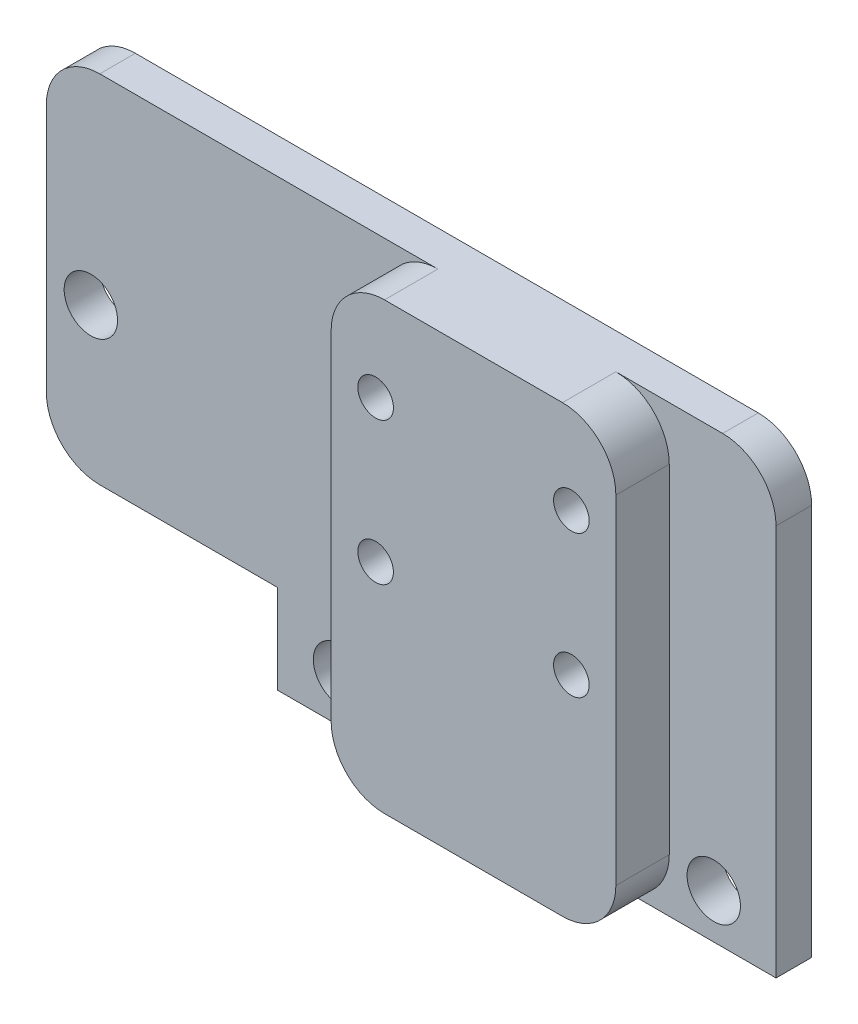
ISO-10303-21;
HEADER;
FILE_DESCRIPTION(('STEP AP214'),'2;1');
FILE_NAME('part.step','',(''),(''),'','','');
FILE_SCHEMA(('AUTOMOTIVE_DESIGN { 1 0 10303 214 1 1 1 1 }'));
ENDSEC;
DATA;
#1=APPLICATION_CONTEXT('core data for automotive mechanical design processes');
#2=APPLICATION_PROTOCOL_DEFINITION('international standard','automotive_design',2000,#1);
#3=PRODUCT_CONTEXT('',#1,'mechanical');
#4=PRODUCT('Part','Part','',(#3));
#5=PRODUCT_RELATED_PRODUCT_CATEGORY('part','',(#4));
#6=PRODUCT_DEFINITION_FORMATION('','',#4);
#7=PRODUCT_DEFINITION_CONTEXT('part definition',#1,'design');
#8=PRODUCT_DEFINITION('design','',#6,#7);
#9=PRODUCT_DEFINITION_SHAPE('','',#8);
#10=(LENGTH_UNIT() NAMED_UNIT(*) SI_UNIT(.MILLI.,.METRE.));
#11=(NAMED_UNIT(*) PLANE_ANGLE_UNIT() SI_UNIT($,.RADIAN.));
#12=(NAMED_UNIT(*) SI_UNIT($,.STERADIAN.) SOLID_ANGLE_UNIT());
#13=UNCERTAINTY_MEASURE_WITH_UNIT(LENGTH_MEASURE(1.E-05),#10,'distance_accuracy_value','');
#14=(GEOMETRIC_REPRESENTATION_CONTEXT(3) GLOBAL_UNCERTAINTY_ASSIGNED_CONTEXT((#13)) GLOBAL_UNIT_ASSIGNED_CONTEXT((#10,
#11,#12)) REPRESENTATION_CONTEXT('',''));
#15=CARTESIAN_POINT('',(0.,0.,0.));
#16=DIRECTION('',(0.,0.,1.));
#17=DIRECTION('',(1.,0.,0.));
#18=AXIS2_PLACEMENT_3D('',#15,#16,#17);
#19=CARTESIAN_POINT('',(0.,0.,2.));
#20=DIRECTION('',(0.,0.,-1.));
#21=DIRECTION('',(-1.,0.,0.));
#22=AXIS2_PLACEMENT_3D('',#19,#20,#21);
#23=PLANE('',#22);
#24=CARTESIAN_POINT('',(-10.5,2.5,2.));
#25=DIRECTION('',(0.,0.,1.));
#26=DIRECTION('',(1.,0.,0.));
#27=AXIS2_PLACEMENT_3D('',#24,#25,#26);
#28=CIRCLE('',#27,1.5);
#29=CARTESIAN_POINT('',(-9.,2.5,2.));
#30=VERTEX_POINT('',#29);
#31=EDGE_CURVE('E345',#30,#30,#28,.T.);
#32=ORIENTED_EDGE('',*,*,#31,.F.);
#33=EDGE_LOOP('',(#32));
#34=FACE_BOUND('',#33,.T.);
#35=CARTESIAN_POINT('',(-24.5,13.5,2.));
#36=DIRECTION('',(0.,0.,1.));
#37=DIRECTION('',(1.,0.,0.));
#38=AXIS2_PLACEMENT_3D('',#35,#36,#37);
#39=CIRCLE('',#38,1.5);
#40=CARTESIAN_POINT('',(-23.,13.5,2.));
#41=VERTEX_POINT('',#40);
#42=EDGE_CURVE('E293',#41,#41,#39,.T.);
#43=ORIENTED_EDGE('',*,*,#42,.F.);
#44=EDGE_LOOP('',(#43));
#45=FACE_BOUND('',#44,.T.);
#46=DIRECTION('',(0.,-1.,0.));
#47=VECTOR('',#46,1.);
#48=CARTESIAN_POINT('',(-27.,5.,2.));
#49=LINE('',#48,#47);
#50=CARTESIAN_POINT('',(-27.,22.,2.));
#51=VERTEX_POINT('',#50);
#52=CARTESIAN_POINT('',(-27.,7.99999999999999,2.));
#53=VERTEX_POINT('',#52);
#54=EDGE_CURVE('E164',#51,#53,#49,.T.);
#55=ORIENTED_EDGE('',*,*,#54,.T.);
#56=CARTESIAN_POINT('',(-24.,7.99999999999999,2.));
#57=DIRECTION('',(0.,0.,-1.));
#58=DIRECTION('',(-1.,0.,0.));
#59=AXIS2_PLACEMENT_3D('',#56,#57,#58);
#60=CIRCLE('',#59,3.);
#61=CARTESIAN_POINT('',(-24.,5.,2.));
#62=VERTEX_POINT('',#61);
#63=EDGE_CURVE('E160',#53,#62,#60,.F.);
#64=ORIENTED_EDGE('',*,*,#63,.T.);
#65=DIRECTION('',(1.,0.,0.));
#66=VECTOR('',#65,1.);
#67=CARTESIAN_POINT('',(-14.,5.,2.));
#68=LINE('',#67,#66);
#69=CARTESIAN_POINT('',(-14.,5.,2.));
#70=VERTEX_POINT('',#69);
#71=EDGE_CURVE('E154',#62,#70,#68,.T.);
#72=ORIENTED_EDGE('',*,*,#71,.T.);
#73=DIRECTION('',(0.,-1.,0.));
#74=VECTOR('',#73,1.);
#75=CARTESIAN_POINT('',(-14.,0.,2.));
#76=LINE('',#75,#74);
#77=CARTESIAN_POINT('',(-14.,0.,2.));
#78=VERTEX_POINT('',#77);
#79=EDGE_CURVE('E157',#70,#78,#76,.T.);
#80=ORIENTED_EDGE('',*,*,#79,.T.);
#81=DIRECTION('',(1.,0.,0.));
#82=VECTOR('',#81,1.);
#83=CARTESIAN_POINT('',(14.,0.,2.));
#84=LINE('',#83,#82);
#85=CARTESIAN_POINT('',(-5.,0.,2.));
#86=VERTEX_POINT('',#85);
#87=EDGE_CURVE('E181',#78,#86,#84,.T.);
#88=ORIENTED_EDGE('',*,*,#87,.T.);
#89=CARTESIAN_POINT('',(-5.,3.,2.));
#90=DIRECTION('',(0.,0.,-1.));
#91=DIRECTION('',(-1.,0.,0.));
#92=AXIS2_PLACEMENT_3D('',#89,#90,#91);
#93=CIRCLE('',#92,3.);
#94=CARTESIAN_POINT('',(-8.,3.,2.));
#95=VERTEX_POINT('',#94);
#96=EDGE_CURVE('E250',#86,#95,#93,.T.);
#97=ORIENTED_EDGE('',*,*,#96,.T.);
#98=DIRECTION('',(0.,-1.,0.));
#99=VECTOR('',#98,1.);
#100=CARTESIAN_POINT('',(-8.,25.,2.));
#101=LINE('',#100,#99);
#102=CARTESIAN_POINT('',(-8.,22.,2.));
#103=VERTEX_POINT('',#102);
#104=EDGE_CURVE('E270',#103,#95,#101,.T.);
#105=ORIENTED_EDGE('',*,*,#104,.F.);
#106=CARTESIAN_POINT('',(-5.,22.,2.));
#107=DIRECTION('',(0.,0.,-1.));
#108=DIRECTION('',(-1.,0.,0.));
#109=AXIS2_PLACEMENT_3D('',#106,#107,#108);
#110=CIRCLE('',#109,3.);
#111=CARTESIAN_POINT('',(-5.,25.,2.));
#112=VERTEX_POINT('',#111);
#113=EDGE_CURVE('E11',#103,#112,#110,.T.);
#114=ORIENTED_EDGE('',*,*,#113,.T.);
#115=DIRECTION('',(-1.,0.,0.));
#116=VECTOR('',#115,1.);
#117=CARTESIAN_POINT('',(-27.,25.,2.));
#118=LINE('',#117,#116);
#119=CARTESIAN_POINT('',(-24.,25.,2.));
#120=VERTEX_POINT('',#119);
#121=EDGE_CURVE('E213',#112,#120,#118,.T.);
#122=ORIENTED_EDGE('',*,*,#121,.T.);
#123=CARTESIAN_POINT('',(-24.,22.,2.));
#124=DIRECTION('',(0.,0.,-1.));
#125=DIRECTION('',(-1.,0.,0.));
#126=AXIS2_PLACEMENT_3D('',#123,#124,#125);
#127=CIRCLE('',#126,3.);
#128=EDGE_CURVE('E241',#120,#51,#127,.F.);
#129=ORIENTED_EDGE('',*,*,#128,.T.);
#130=EDGE_LOOP('',(#55,#64,#72,#80,#88,#97,#105,#114,#122,#129));
#131=FACE_BOUND('',#130,.T.);
#132=ADVANCED_FACE('F33',(#34,#45,#131),#23,.F.);
#133=CARTESIAN_POINT('',(10.5,2.5,2.));
#134=DIRECTION('',(0.,0.,1.));
#135=DIRECTION('',(1.,0.,0.));
#136=AXIS2_PLACEMENT_3D('',#133,#134,#135);
#137=CIRCLE('',#136,1.5);
#138=CARTESIAN_POINT('',(12.,2.5,2.));
#139=VERTEX_POINT('',#138);
#140=EDGE_CURVE('E351',#139,#139,#137,.T.);
#141=ORIENTED_EDGE('',*,*,#140,.F.);
#142=EDGE_LOOP('',(#141));
#143=FACE_BOUND('',#142,.T.);
#144=DIRECTION('',(0.,1.,0.));
#145=VECTOR('',#144,1.);
#146=CARTESIAN_POINT('',(14.,5.,2.));
#147=LINE('',#146,#145);
#148=CARTESIAN_POINT('',(14.,0.,2.));
#149=VERTEX_POINT('',#148);
#150=CARTESIAN_POINT('',(14.,22.,2.));
#151=VERTEX_POINT('',#150);
#152=EDGE_CURVE('E187',#149,#151,#147,.T.);
#153=ORIENTED_EDGE('',*,*,#152,.T.);
#154=CARTESIAN_POINT('',(11.,22.,2.));
#155=DIRECTION('',(0.,0.,-1.));
#156=DIRECTION('',(-1.,0.,0.));
#157=AXIS2_PLACEMENT_3D('',#154,#155,#156);
#158=CIRCLE('',#157,3.);
#159=CARTESIAN_POINT('',(11.,25.,2.));
#160=VERTEX_POINT('',#159);
#161=EDGE_CURVE('E48',#151,#160,#158,.F.);
#162=ORIENTED_EDGE('',*,*,#161,.T.);
#163=CARTESIAN_POINT('',(5.,25.,2.));
#164=VERTEX_POINT('',#163);
#165=EDGE_CURVE('E197',#160,#164,#118,.T.);
#166=ORIENTED_EDGE('',*,*,#165,.T.);
#167=CARTESIAN_POINT('',(5.,22.,2.));
#168=DIRECTION('',(0.,0.,-1.));
#169=DIRECTION('',(-1.,0.,0.));
#170=AXIS2_PLACEMENT_3D('',#167,#168,#169);
#171=CIRCLE('',#170,3.);
#172=CARTESIAN_POINT('',(8.,22.,2.));
#173=VERTEX_POINT('',#172);
#174=EDGE_CURVE('E41',#164,#173,#171,.T.);
#175=ORIENTED_EDGE('',*,*,#174,.T.);
#176=DIRECTION('',(0.,1.,0.));
#177=VECTOR('',#176,1.);
#178=CARTESIAN_POINT('',(8.,25.,2.));
#179=LINE('',#178,#177);
#180=CARTESIAN_POINT('',(8.,3.,2.));
#181=VERTEX_POINT('',#180);
#182=EDGE_CURVE('E257',#181,#173,#179,.T.);
#183=ORIENTED_EDGE('',*,*,#182,.F.);
#184=CARTESIAN_POINT('',(5.,3.,2.));
#185=DIRECTION('',(0.,0.,-1.));
#186=DIRECTION('',(-1.,0.,0.));
#187=AXIS2_PLACEMENT_3D('',#184,#185,#186);
#188=CIRCLE('',#187,3.);
#189=CARTESIAN_POINT('',(5.,0.,2.));
#190=VERTEX_POINT('',#189);
#191=EDGE_CURVE('E247',#181,#190,#188,.T.);
#192=ORIENTED_EDGE('',*,*,#191,.T.);
#193=EDGE_CURVE('E179',#190,#149,#84,.T.);
#194=ORIENTED_EDGE('',*,*,#193,.T.);
#195=EDGE_LOOP('',(#153,#162,#166,#175,#183,#192,#194));
#196=FACE_BOUND('',#195,.T.);
#197=ADVANCED_FACE('F256',(#143,#196),#23,.F.);
#198=CARTESIAN_POINT('',(-27.,5.,2.));
#199=DIRECTION('',(1.,0.,0.));
#200=DIRECTION('',(0.,0.,-1.));
#201=AXIS2_PLACEMENT_3D('',#198,#199,#200);
#202=PLANE('',#201);
#203=DIRECTION('',(0.,-1.,0.));
#204=VECTOR('',#203,1.);
#205=CARTESIAN_POINT('',(-27.,5.,0.));
#206=LINE('',#205,#204);
#207=CARTESIAN_POINT('',(-27.,22.,0.));
#208=VERTEX_POINT('',#207);
#209=CARTESIAN_POINT('',(-27.,7.99999999999999,0.));
#210=VERTEX_POINT('',#209);
#211=EDGE_CURVE('E209',#208,#210,#206,.T.);
#212=ORIENTED_EDGE('',*,*,#211,.T.);
#213=DIRECTION('',(0.,0.,-1.));
#214=VECTOR('',#213,1.);
#215=CARTESIAN_POINT('',(-27.,7.99999999999999,2.));
#216=LINE('',#215,#214);
#217=EDGE_CURVE('E56',#210,#53,#216,.F.);
#218=ORIENTED_EDGE('',*,*,#217,.T.);
#219=ORIENTED_EDGE('',*,*,#54,.F.);
#220=DIRECTION('',(0.,0.,-1.));
#221=VECTOR('',#220,1.);
#222=CARTESIAN_POINT('',(-27.,22.,2.));
#223=LINE('',#222,#221);
#224=EDGE_CURVE('E237',#51,#208,#223,.T.);
#225=ORIENTED_EDGE('',*,*,#224,.T.);
#226=EDGE_LOOP('',(#212,#218,#219,#225));
#227=FACE_BOUND('',#226,.T.);
#228=ADVANCED_FACE('F419',(#227),#202,.F.);
#229=CARTESIAN_POINT('',(-14.,5.,2.));
#230=DIRECTION('',(0.,1.,0.));
#231=DIRECTION('',(-1.,0.,0.));
#232=AXIS2_PLACEMENT_3D('',#229,#230,#231);
#233=PLANE('',#232);
#234=ORIENTED_EDGE('',*,*,#71,.F.);
#235=DIRECTION('',(0.,0.,-1.));
#236=VECTOR('',#235,1.);
#237=CARTESIAN_POINT('',(-24.,5.,2.));
#238=LINE('',#237,#236);
#239=CARTESIAN_POINT('',(-24.,5.,0.));
#240=VERTEX_POINT('',#239);
#241=EDGE_CURVE('E229',#62,#240,#238,.T.);
#242=ORIENTED_EDGE('',*,*,#241,.T.);
#243=DIRECTION('',(1.,0.,0.));
#244=VECTOR('',#243,1.);
#245=CARTESIAN_POINT('',(-14.,5.,0.));
#246=LINE('',#245,#244);
#247=CARTESIAN_POINT('',(-14.,5.,0.));
#248=VERTEX_POINT('',#247);
#249=EDGE_CURVE('E170',#240,#248,#246,.T.);
#250=ORIENTED_EDGE('',*,*,#249,.T.);
#251=DIRECTION('',(0.,0.,-1.));
#252=VECTOR('',#251,1.);
#253=CARTESIAN_POINT('',(-14.,5.,2.));
#254=LINE('',#253,#252);
#255=EDGE_CURVE('E167',#70,#248,#254,.T.);
#256=ORIENTED_EDGE('',*,*,#255,.F.);
#257=EDGE_LOOP('',(#234,#242,#250,#256));
#258=FACE_BOUND('',#257,.T.);
#259=ADVANCED_FACE('F168',(#258),#233,.F.);
#260=CARTESIAN_POINT('',(-14.,0.,2.));
#261=DIRECTION('',(1.,0.,0.));
#262=DIRECTION('',(0.,0.,-1.));
#263=AXIS2_PLACEMENT_3D('',#260,#261,#262);
#264=PLANE('',#263);
#265=DIRECTION('',(0.,-1.,0.));
#266=VECTOR('',#265,1.);
#267=CARTESIAN_POINT('',(-14.,0.,0.));
#268=LINE('',#267,#266);
#269=CARTESIAN_POINT('',(-14.,0.,0.));
#270=VERTEX_POINT('',#269);
#271=EDGE_CURVE('E206',#248,#270,#268,.T.);
#272=ORIENTED_EDGE('',*,*,#271,.T.);
#273=DIRECTION('',(0.,0.,-1.));
#274=VECTOR('',#273,1.);
#275=CARTESIAN_POINT('',(-14.,0.,2.));
#276=LINE('',#275,#274);
#277=EDGE_CURVE('E174',#78,#270,#276,.T.);
#278=ORIENTED_EDGE('',*,*,#277,.F.);
#279=ORIENTED_EDGE('',*,*,#79,.F.);
#280=ORIENTED_EDGE('',*,*,#255,.T.);
#281=EDGE_LOOP('',(#272,#278,#279,#280));
#282=FACE_BOUND('',#281,.T.);
#283=ADVANCED_FACE('F176',(#282),#264,.F.);
#284=CARTESIAN_POINT('',(14.,0.,2.));
#285=DIRECTION('',(0.,1.,0.));
#286=DIRECTION('',(0.,0.,1.));
#287=AXIS2_PLACEMENT_3D('',#284,#285,#286);
#288=PLANE('',#287);
#289=ORIENTED_EDGE('',*,*,#193,.F.);
#290=DIRECTION('',(0.,0.,-1.));
#291=VECTOR('',#290,1.);
#292=CARTESIAN_POINT('',(5.,0.,2.));
#293=LINE('',#292,#291);
#294=CARTESIAN_POINT('',(5.,0.,5.));
#295=VERTEX_POINT('',#294);
#296=EDGE_CURVE('E281',#190,#295,#293,.F.);
#297=ORIENTED_EDGE('',*,*,#296,.T.);
#298=DIRECTION('',(1.,0.,0.));
#299=VECTOR('',#298,1.);
#300=CARTESIAN_POINT('',(-8.,0.,5.));
#301=LINE('',#300,#299);
#302=CARTESIAN_POINT('',(-5.,0.,5.));
#303=VERTEX_POINT('',#302);
#304=EDGE_CURVE('E338',#303,#295,#301,.T.);
#305=ORIENTED_EDGE('',*,*,#304,.F.);
#306=DIRECTION('',(0.,0.,-1.));
#307=VECTOR('',#306,1.);
#308=CARTESIAN_POINT('',(-5.,0.,2.));
#309=LINE('',#308,#307);
#310=EDGE_CURVE('E275',#303,#86,#309,.T.);
#311=ORIENTED_EDGE('',*,*,#310,.T.);
#312=ORIENTED_EDGE('',*,*,#87,.F.);
#313=ORIENTED_EDGE('',*,*,#277,.T.);
#314=DIRECTION('',(1.,0.,0.));
#315=VECTOR('',#314,1.);
#316=CARTESIAN_POINT('',(14.,0.,0.));
#317=LINE('',#316,#315);
#318=CARTESIAN_POINT('',(14.,0.,0.));
#319=VERTEX_POINT('',#318);
#320=EDGE_CURVE('E204',#270,#319,#317,.T.);
#321=ORIENTED_EDGE('',*,*,#320,.T.);
#322=DIRECTION('',(0.,0.,-1.));
#323=VECTOR('',#322,1.);
#324=CARTESIAN_POINT('',(14.,0.,2.));
#325=LINE('',#324,#323);
#326=EDGE_CURVE('E194',#149,#319,#325,.T.);
#327=ORIENTED_EDGE('',*,*,#326,.F.);
#328=EDGE_LOOP('',(#289,#297,#305,#311,#312,#313,#321,#327));
#329=FACE_BOUND('',#328,.T.);
#330=ADVANCED_FACE('F310',(#329),#288,.F.);
#331=CARTESIAN_POINT('',(14.,5.,2.));
#332=DIRECTION('',(-1.,0.,0.));
#333=DIRECTION('',(0.,0.,1.));
#334=AXIS2_PLACEMENT_3D('',#331,#332,#333);
#335=PLANE('',#334);
#336=DIRECTION('',(0.,1.,0.));
#337=VECTOR('',#336,1.);
#338=CARTESIAN_POINT('',(14.,5.,0.));
#339=LINE('',#338,#337);
#340=CARTESIAN_POINT('',(14.,22.,0.));
#341=VERTEX_POINT('',#340);
#342=EDGE_CURVE('E201',#319,#341,#339,.T.);
#343=ORIENTED_EDGE('',*,*,#342,.T.);
#344=DIRECTION('',(0.,0.,1.));
#345=VECTOR('',#344,1.);
#346=CARTESIAN_POINT('',(14.,22.,2.));
#347=LINE('',#346,#345);
#348=EDGE_CURVE('E244',#341,#151,#347,.T.);
#349=ORIENTED_EDGE('',*,*,#348,.T.);
#350=ORIENTED_EDGE('',*,*,#152,.F.);
#351=ORIENTED_EDGE('',*,*,#326,.T.);
#352=EDGE_LOOP('',(#343,#349,#350,#351));
#353=FACE_BOUND('',#352,.T.);
#354=ADVANCED_FACE('F430',(#353),#335,.F.);
#355=CARTESIAN_POINT('',(-27.,25.,2.));
#356=DIRECTION('',(0.,-1.,0.));
#357=DIRECTION('',(0.,0.,-1.));
#358=AXIS2_PLACEMENT_3D('',#355,#356,#357);
#359=PLANE('',#358);
#360=DIRECTION('',(-1.,0.,0.));
#361=VECTOR('',#360,1.);
#362=CARTESIAN_POINT('',(-8.,25.,5.));
#363=LINE('',#362,#361);
#364=CARTESIAN_POINT('',(5.,25.,5.));
#365=VERTEX_POINT('',#364);
#366=CARTESIAN_POINT('',(-5.,25.,5.));
#367=VERTEX_POINT('',#366);
#368=EDGE_CURVE('E210',#365,#367,#363,.T.);
#369=ORIENTED_EDGE('',*,*,#368,.F.);
#370=DIRECTION('',(0.,0.,-1.));
#371=VECTOR('',#370,1.);
#372=CARTESIAN_POINT('',(5.,25.,2.));
#373=LINE('',#372,#371);
#374=EDGE_CURVE('E226',#365,#164,#373,.T.);
#375=ORIENTED_EDGE('',*,*,#374,.T.);
#376=ORIENTED_EDGE('',*,*,#165,.F.);
#377=DIRECTION('',(0.,0.,1.));
#378=VECTOR('',#377,1.);
#379=CARTESIAN_POINT('',(11.,25.,2.));
#380=LINE('',#379,#378);
#381=CARTESIAN_POINT('',(11.,25.,0.));
#382=VERTEX_POINT('',#381);
#383=EDGE_CURVE('E220',#160,#382,#380,.F.);
#384=ORIENTED_EDGE('',*,*,#383,.T.);
#385=DIRECTION('',(-1.,0.,0.));
#386=VECTOR('',#385,1.);
#387=CARTESIAN_POINT('',(-27.,25.,0.));
#388=LINE('',#387,#386);
#389=CARTESIAN_POINT('',(-24.,25.,0.));
#390=VERTEX_POINT('',#389);
#391=EDGE_CURVE('E198',#382,#390,#388,.T.);
#392=ORIENTED_EDGE('',*,*,#391,.T.);
#393=DIRECTION('',(0.,0.,-1.));
#394=VECTOR('',#393,1.);
#395=CARTESIAN_POINT('',(-24.,25.,2.));
#396=LINE('',#395,#394);
#397=EDGE_CURVE('E222',#390,#120,#396,.F.);
#398=ORIENTED_EDGE('',*,*,#397,.T.);
#399=ORIENTED_EDGE('',*,*,#121,.F.);
#400=DIRECTION('',(0.,0.,-1.));
#401=VECTOR('',#400,1.);
#402=CARTESIAN_POINT('',(-5.,25.,2.));
#403=LINE('',#402,#401);
#404=EDGE_CURVE('E224',#112,#367,#403,.F.);
#405=ORIENTED_EDGE('',*,*,#404,.T.);
#406=EDGE_LOOP('',(#369,#375,#376,#384,#392,#398,#399,#405));
#407=FACE_BOUND('',#406,.T.);
#408=ADVANCED_FACE('F333',(#407),#359,.F.);
#409=CARTESIAN_POINT('',(0.,0.,0.));
#410=DIRECTION('',(0.,0.,-1.));
#411=DIRECTION('',(-1.,0.,0.));
#412=AXIS2_PLACEMENT_3D('',#409,#410,#411);
#413=PLANE('',#412);
#414=ORIENTED_EDGE('',*,*,#249,.F.);
#415=CARTESIAN_POINT('',(-24.,7.99999999999999,0.));
#416=DIRECTION('',(0.,0.,-1.));
#417=DIRECTION('',(-1.,0.,0.));
#418=AXIS2_PLACEMENT_3D('',#415,#416,#417);
#419=CIRCLE('',#418,3.);
#420=EDGE_CURVE('E235',#240,#210,#419,.T.);
#421=ORIENTED_EDGE('',*,*,#420,.T.);
#422=ORIENTED_EDGE('',*,*,#211,.F.);
#423=CARTESIAN_POINT('',(-24.,22.,0.));
#424=DIRECTION('',(0.,0.,-1.));
#425=DIRECTION('',(-1.,0.,0.));
#426=AXIS2_PLACEMENT_3D('',#423,#424,#425);
#427=CIRCLE('',#426,3.);
#428=EDGE_CURVE('E233',#208,#390,#427,.T.);
#429=ORIENTED_EDGE('',*,*,#428,.T.);
#430=ORIENTED_EDGE('',*,*,#391,.F.);
#431=CARTESIAN_POINT('',(11.,22.,0.));
#432=DIRECTION('',(0.,0.,-1.));
#433=DIRECTION('',(-1.,0.,0.));
#434=AXIS2_PLACEMENT_3D('',#431,#432,#433);
#435=CIRCLE('',#434,3.);
#436=EDGE_CURVE('E231',#382,#341,#435,.T.);
#437=ORIENTED_EDGE('',*,*,#436,.T.);
#438=ORIENTED_EDGE('',*,*,#342,.F.);
#439=ORIENTED_EDGE('',*,*,#320,.F.);
#440=ORIENTED_EDGE('',*,*,#271,.F.);
#441=EDGE_LOOP('',(#414,#421,#422,#429,#430,#437,#438,#439,#440));
#442=FACE_BOUND('',#441,.T.);
#443=CARTESIAN_POINT('',(5.5,20.,0.));
#444=DIRECTION('',(0.,0.,-1.));
#445=DIRECTION('',(-1.,0.,0.));
#446=AXIS2_PLACEMENT_3D('',#443,#444,#445);
#447=CIRCLE('',#446,1.);
#448=CARTESIAN_POINT('',(4.5,20.,0.));
#449=VERTEX_POINT('',#448);
#450=EDGE_CURVE('E378',#449,#449,#447,.F.);
#451=ORIENTED_EDGE('',*,*,#450,.T.);
#452=EDGE_LOOP('',(#451));
#453=FACE_BOUND('',#452,.T.);
#454=CARTESIAN_POINT('',(5.5,12.,0.));
#455=DIRECTION('',(0.,0.,-1.));
#456=DIRECTION('',(-1.,0.,0.));
#457=AXIS2_PLACEMENT_3D('',#454,#455,#456);
#458=CIRCLE('',#457,1.);
#459=CARTESIAN_POINT('',(4.5,12.,0.));
#460=VERTEX_POINT('',#459);
#461=EDGE_CURVE('E372',#460,#460,#458,.F.);
#462=ORIENTED_EDGE('',*,*,#461,.T.);
#463=EDGE_LOOP('',(#462));
#464=FACE_BOUND('',#463,.T.);
#465=CARTESIAN_POINT('',(-5.5,12.,0.));
#466=DIRECTION('',(0.,0.,-1.));
#467=DIRECTION('',(-1.,0.,0.));
#468=AXIS2_PLACEMENT_3D('',#465,#466,#467);
#469=CIRCLE('',#468,1.);
#470=CARTESIAN_POINT('',(-6.5,12.,0.));
#471=VERTEX_POINT('',#470);
#472=EDGE_CURVE('E366',#471,#471,#469,.F.);
#473=ORIENTED_EDGE('',*,*,#472,.T.);
#474=EDGE_LOOP('',(#473));
#475=FACE_BOUND('',#474,.T.);
#476=CARTESIAN_POINT('',(-5.5,20.,0.));
#477=DIRECTION('',(0.,0.,-1.));
#478=DIRECTION('',(-1.,0.,0.));
#479=AXIS2_PLACEMENT_3D('',#476,#477,#478);
#480=CIRCLE('',#479,1.);
#481=CARTESIAN_POINT('',(-6.5,20.,0.));
#482=VERTEX_POINT('',#481);
#483=EDGE_CURVE('E360',#482,#482,#480,.F.);
#484=ORIENTED_EDGE('',*,*,#483,.T.);
#485=EDGE_LOOP('',(#484));
#486=FACE_BOUND('',#485,.T.);
#487=CARTESIAN_POINT('',(10.5,2.5,0.));
#488=DIRECTION('',(0.,0.,-1.));
#489=DIRECTION('',(-1.,0.,0.));
#490=AXIS2_PLACEMENT_3D('',#487,#488,#489);
#491=CIRCLE('',#490,1.5);
#492=CARTESIAN_POINT('',(9.,2.5,0.));
#493=VERTEX_POINT('',#492);
#494=EDGE_CURVE('E354',#493,#493,#491,.F.);
#495=ORIENTED_EDGE('',*,*,#494,.T.);
#496=EDGE_LOOP('',(#495));
#497=FACE_BOUND('',#496,.T.);
#498=CARTESIAN_POINT('',(-10.5,2.5,0.));
#499=DIRECTION('',(0.,0.,-1.));
#500=DIRECTION('',(-1.,0.,0.));
#501=AXIS2_PLACEMENT_3D('',#498,#499,#500);
#502=CIRCLE('',#501,1.5);
#503=CARTESIAN_POINT('',(-12.,2.5,0.));
#504=VERTEX_POINT('',#503);
#505=EDGE_CURVE('E348',#504,#504,#502,.F.);
#506=ORIENTED_EDGE('',*,*,#505,.T.);
#507=EDGE_LOOP('',(#506));
#508=FACE_BOUND('',#507,.T.);
#509=CARTESIAN_POINT('',(-24.5,13.5,0.));
#510=DIRECTION('',(0.,0.,-1.));
#511=DIRECTION('',(-1.,0.,0.));
#512=AXIS2_PLACEMENT_3D('',#509,#510,#511);
#513=CIRCLE('',#512,1.5);
#514=CARTESIAN_POINT('',(-26.,13.5,0.));
#515=VERTEX_POINT('',#514);
#516=EDGE_CURVE('E342',#515,#515,#513,.F.);
#517=ORIENTED_EDGE('',*,*,#516,.T.);
#518=EDGE_LOOP('',(#517));
#519=FACE_BOUND('',#518,.T.);
#520=ADVANCED_FACE('F304',(#442,#453,#464,#475,#486,#497,#508,#519),#413,.T.);
#521=CARTESIAN_POINT('',(-8.,25.,5.));
#522=DIRECTION('',(1.,0.,0.));
#523=DIRECTION('',(0.,0.,-1.));
#524=AXIS2_PLACEMENT_3D('',#521,#522,#523);
#525=PLANE('',#524);
#526=ORIENTED_EDGE('',*,*,#104,.T.);
#527=DIRECTION('',(0.,0.,-1.));
#528=VECTOR('',#527,1.);
#529=CARTESIAN_POINT('',(-8.,3.,5.));
#530=LINE('',#529,#528);
#531=CARTESIAN_POINT('',(-8.,3.,5.));
#532=VERTEX_POINT('',#531);
#533=EDGE_CURVE('E218',#95,#532,#530,.F.);
#534=ORIENTED_EDGE('',*,*,#533,.T.);
#535=DIRECTION('',(0.,-1.,0.));
#536=VECTOR('',#535,1.);
#537=CARTESIAN_POINT('',(-8.,25.,5.));
#538=LINE('',#537,#536);
#539=CARTESIAN_POINT('',(-8.,22.,5.));
#540=VERTEX_POINT('',#539);
#541=EDGE_CURVE('E269',#540,#532,#538,.T.);
#542=ORIENTED_EDGE('',*,*,#541,.F.);
#543=DIRECTION('',(0.,0.,-1.));
#544=VECTOR('',#543,1.);
#545=CARTESIAN_POINT('',(-8.,22.,5.));
#546=LINE('',#545,#544);
#547=EDGE_CURVE('E290',#540,#103,#546,.T.);
#548=ORIENTED_EDGE('',*,*,#547,.T.);
#549=EDGE_LOOP('',(#526,#534,#542,#548));
#550=FACE_BOUND('',#549,.T.);
#551=ADVANCED_FACE('F325',(#550),#525,.F.);
#552=CARTESIAN_POINT('',(8.,25.,5.));
#553=DIRECTION('',(-1.,0.,0.));
#554=DIRECTION('',(0.,0.,1.));
#555=AXIS2_PLACEMENT_3D('',#552,#553,#554);
#556=PLANE('',#555);
#557=DIRECTION('',(0.,1.,0.));
#558=VECTOR('',#557,1.);
#559=CARTESIAN_POINT('',(8.,25.,5.));
#560=LINE('',#559,#558);
#561=CARTESIAN_POINT('',(8.,3.,5.));
#562=VERTEX_POINT('',#561);
#563=CARTESIAN_POINT('',(8.,22.,5.));
#564=VERTEX_POINT('',#563);
#565=EDGE_CURVE('E337',#562,#564,#560,.T.);
#566=ORIENTED_EDGE('',*,*,#565,.F.);
#567=DIRECTION('',(0.,0.,-1.));
#568=VECTOR('',#567,1.);
#569=CARTESIAN_POINT('',(8.,3.,5.));
#570=LINE('',#569,#568);
#571=EDGE_CURVE('E268',#562,#181,#570,.T.);
#572=ORIENTED_EDGE('',*,*,#571,.T.);
#573=ORIENTED_EDGE('',*,*,#182,.T.);
#574=DIRECTION('',(0.,0.,-1.));
#575=VECTOR('',#574,1.);
#576=CARTESIAN_POINT('',(8.,22.,5.));
#577=LINE('',#576,#575);
#578=EDGE_CURVE('E173',#173,#564,#577,.F.);
#579=ORIENTED_EDGE('',*,*,#578,.T.);
#580=EDGE_LOOP('',(#566,#572,#573,#579));
#581=FACE_BOUND('',#580,.T.);
#582=ADVANCED_FACE('F265',(#581),#556,.F.);
#583=CARTESIAN_POINT('',(0.,0.,5.));
#584=DIRECTION('',(0.,0.,1.));
#585=DIRECTION('',(1.,0.,0.));
#586=AXIS2_PLACEMENT_3D('',#583,#584,#585);
#587=PLANE('',#586);
#588=CARTESIAN_POINT('',(5.5,20.,5.));
#589=DIRECTION('',(0.,0.,1.));
#590=DIRECTION('',(1.,0.,0.));
#591=AXIS2_PLACEMENT_3D('',#588,#589,#590);
#592=CIRCLE('',#591,1.);
#593=CARTESIAN_POINT('',(6.5,20.,5.));
#594=VERTEX_POINT('',#593);
#595=EDGE_CURVE('E375',#594,#594,#592,.T.);
#596=ORIENTED_EDGE('',*,*,#595,.F.);
#597=EDGE_LOOP('',(#596));
#598=FACE_BOUND('',#597,.T.);
#599=CARTESIAN_POINT('',(5.5,12.,5.));
#600=DIRECTION('',(0.,0.,1.));
#601=DIRECTION('',(1.,0.,0.));
#602=AXIS2_PLACEMENT_3D('',#599,#600,#601);
#603=CIRCLE('',#602,1.);
#604=CARTESIAN_POINT('',(6.5,12.,5.));
#605=VERTEX_POINT('',#604);
#606=EDGE_CURVE('E369',#605,#605,#603,.T.);
#607=ORIENTED_EDGE('',*,*,#606,.F.);
#608=EDGE_LOOP('',(#607));
#609=FACE_BOUND('',#608,.T.);
#610=CARTESIAN_POINT('',(-5.5,12.,5.));
#611=DIRECTION('',(0.,0.,1.));
#612=DIRECTION('',(1.,0.,0.));
#613=AXIS2_PLACEMENT_3D('',#610,#611,#612);
#614=CIRCLE('',#613,1.);
#615=CARTESIAN_POINT('',(-4.5,12.,5.));
#616=VERTEX_POINT('',#615);
#617=EDGE_CURVE('E363',#616,#616,#614,.T.);
#618=ORIENTED_EDGE('',*,*,#617,.F.);
#619=EDGE_LOOP('',(#618));
#620=FACE_BOUND('',#619,.T.);
#621=CARTESIAN_POINT('',(-5.5,20.,5.));
#622=DIRECTION('',(0.,0.,1.));
#623=DIRECTION('',(1.,0.,0.));
#624=AXIS2_PLACEMENT_3D('',#621,#622,#623);
#625=CIRCLE('',#624,1.);
#626=CARTESIAN_POINT('',(-4.5,20.,5.));
#627=VERTEX_POINT('',#626);
#628=EDGE_CURVE('E357',#627,#627,#625,.T.);
#629=ORIENTED_EDGE('',*,*,#628,.F.);
#630=EDGE_LOOP('',(#629));
#631=FACE_BOUND('',#630,.T.);
#632=ORIENTED_EDGE('',*,*,#304,.T.);
#633=CARTESIAN_POINT('',(5.,3.,5.));
#634=DIRECTION('',(0.,0.,1.));
#635=DIRECTION('',(1.,0.,0.));
#636=AXIS2_PLACEMENT_3D('',#633,#634,#635);
#637=CIRCLE('',#636,3.);
#638=EDGE_CURVE('E288',#295,#562,#637,.T.);
#639=ORIENTED_EDGE('',*,*,#638,.T.);
#640=ORIENTED_EDGE('',*,*,#565,.T.);
#641=CARTESIAN_POINT('',(5.,22.,5.));
#642=DIRECTION('',(0.,0.,1.));
#643=DIRECTION('',(1.,0.,0.));
#644=AXIS2_PLACEMENT_3D('',#641,#642,#643);
#645=CIRCLE('',#644,3.);
#646=EDGE_CURVE('E273',#564,#365,#645,.T.);
#647=ORIENTED_EDGE('',*,*,#646,.T.);
#648=ORIENTED_EDGE('',*,*,#368,.T.);
#649=CARTESIAN_POINT('',(-5.,22.,5.));
#650=DIRECTION('',(0.,0.,1.));
#651=DIRECTION('',(1.,0.,0.));
#652=AXIS2_PLACEMENT_3D('',#649,#650,#651);
#653=CIRCLE('',#652,3.);
#654=EDGE_CURVE('E283',#367,#540,#653,.T.);
#655=ORIENTED_EDGE('',*,*,#654,.T.);
#656=ORIENTED_EDGE('',*,*,#541,.T.);
#657=CARTESIAN_POINT('',(-5.,3.,5.));
#658=DIRECTION('',(0.,0.,1.));
#659=DIRECTION('',(1.,0.,0.));
#660=AXIS2_PLACEMENT_3D('',#657,#658,#659);
#661=CIRCLE('',#660,3.);
#662=EDGE_CURVE('E286',#532,#303,#661,.T.);
#663=ORIENTED_EDGE('',*,*,#662,.T.);
#664=EDGE_LOOP('',(#632,#639,#640,#647,#648,#655,#656,#663));
#665=FACE_BOUND('',#664,.T.);
#666=ADVANCED_FACE('F336',(#598,#609,#620,#631,#665),#587,.T.);
#667=CARTESIAN_POINT('',(-24.5,13.5,-0.00100000000000013));
#668=DIRECTION('',(0.,0.,1.));
#669=DIRECTION('',(1.,0.,0.));
#670=AXIS2_PLACEMENT_3D('',#667,#668,#669);
#671=CYLINDRICAL_SURFACE('',#670,1.5);
#672=ORIENTED_EDGE('',*,*,#516,.F.);
#673=EDGE_LOOP('',(#672));
#674=FACE_BOUND('',#673,.T.);
#675=ORIENTED_EDGE('',*,*,#42,.T.);
#676=EDGE_LOOP('',(#675));
#677=FACE_BOUND('',#676,.T.);
#678=ADVANCED_FACE('F388',(#674,#677),#671,.F.);
#679=CARTESIAN_POINT('',(-10.5,2.5,-0.00100000000000013));
#680=DIRECTION('',(0.,0.,1.));
#681=DIRECTION('',(1.,0.,0.));
#682=AXIS2_PLACEMENT_3D('',#679,#680,#681);
#683=CYLINDRICAL_SURFACE('',#682,1.5);
#684=ORIENTED_EDGE('',*,*,#505,.F.);
#685=EDGE_LOOP('',(#684));
#686=FACE_BOUND('',#685,.T.);
#687=ORIENTED_EDGE('',*,*,#31,.T.);
#688=EDGE_LOOP('',(#687));
#689=FACE_BOUND('',#688,.T.);
#690=ADVANCED_FACE('F409',(#686,#689),#683,.F.);
#691=CARTESIAN_POINT('',(10.5,2.5,-0.00100000000000013));
#692=DIRECTION('',(0.,0.,1.));
#693=DIRECTION('',(1.,0.,0.));
#694=AXIS2_PLACEMENT_3D('',#691,#692,#693);
#695=CYLINDRICAL_SURFACE('',#694,1.5);
#696=ORIENTED_EDGE('',*,*,#494,.F.);
#697=EDGE_LOOP('',(#696));
#698=FACE_BOUND('',#697,.T.);
#699=ORIENTED_EDGE('',*,*,#140,.T.);
#700=EDGE_LOOP('',(#699));
#701=FACE_BOUND('',#700,.T.);
#702=ADVANCED_FACE('F399',(#698,#701),#695,.F.);
#703=CARTESIAN_POINT('',(-5.5,20.,-0.00100000000000013));
#704=DIRECTION('',(0.,0.,1.));
#705=DIRECTION('',(1.,0.,0.));
#706=AXIS2_PLACEMENT_3D('',#703,#704,#705);
#707=CYLINDRICAL_SURFACE('',#706,1.);
#708=ORIENTED_EDGE('',*,*,#483,.F.);
#709=EDGE_LOOP('',(#708));
#710=FACE_BOUND('',#709,.T.);
#711=ORIENTED_EDGE('',*,*,#628,.T.);
#712=EDGE_LOOP('',(#711));
#713=FACE_BOUND('',#712,.T.);
#714=ADVANCED_FACE('F396',(#710,#713),#707,.F.);
#715=CARTESIAN_POINT('',(-5.5,12.,-0.00100000000000013));
#716=DIRECTION('',(0.,0.,1.));
#717=DIRECTION('',(1.,0.,0.));
#718=AXIS2_PLACEMENT_3D('',#715,#716,#717);
#719=CYLINDRICAL_SURFACE('',#718,1.);
#720=ORIENTED_EDGE('',*,*,#472,.F.);
#721=EDGE_LOOP('',(#720));
#722=FACE_BOUND('',#721,.T.);
#723=ORIENTED_EDGE('',*,*,#617,.T.);
#724=EDGE_LOOP('',(#723));
#725=FACE_BOUND('',#724,.T.);
#726=ADVANCED_FACE('F398',(#722,#725),#719,.F.);
#727=CARTESIAN_POINT('',(5.5,12.,-0.00100000000000013));
#728=DIRECTION('',(0.,0.,1.));
#729=DIRECTION('',(1.,0.,0.));
#730=AXIS2_PLACEMENT_3D('',#727,#728,#729);
#731=CYLINDRICAL_SURFACE('',#730,1.);
#732=ORIENTED_EDGE('',*,*,#461,.F.);
#733=EDGE_LOOP('',(#732));
#734=FACE_BOUND('',#733,.T.);
#735=ORIENTED_EDGE('',*,*,#606,.T.);
#736=EDGE_LOOP('',(#735));
#737=FACE_BOUND('',#736,.T.);
#738=ADVANCED_FACE('F406',(#734,#737),#731,.F.);
#739=CARTESIAN_POINT('',(5.5,20.,-0.00100000000000013));
#740=DIRECTION('',(0.,0.,1.));
#741=DIRECTION('',(1.,0.,0.));
#742=AXIS2_PLACEMENT_3D('',#739,#740,#741);
#743=CYLINDRICAL_SURFACE('',#742,1.);
#744=ORIENTED_EDGE('',*,*,#450,.F.);
#745=EDGE_LOOP('',(#744));
#746=FACE_BOUND('',#745,.T.);
#747=ORIENTED_EDGE('',*,*,#595,.T.);
#748=EDGE_LOOP('',(#747));
#749=FACE_BOUND('',#748,.T.);
#750=ADVANCED_FACE('F384',(#746,#749),#743,.F.);
#751=CARTESIAN_POINT('',(5.,3.,5.));
#752=DIRECTION('',(0.,0.,-1.));
#753=DIRECTION('',(-1.,0.,0.));
#754=AXIS2_PLACEMENT_3D('',#751,#752,#753);
#755=CYLINDRICAL_SURFACE('',#754,3.);
#756=ORIENTED_EDGE('',*,*,#638,.F.);
#757=ORIENTED_EDGE('',*,*,#296,.F.);
#758=ORIENTED_EDGE('',*,*,#191,.F.);
#759=ORIENTED_EDGE('',*,*,#571,.F.);
#760=EDGE_LOOP('',(#756,#757,#758,#759));
#761=FACE_BOUND('',#760,.T.);
#762=ADVANCED_FACE('F442',(#761),#755,.T.);
#763=CARTESIAN_POINT('',(-5.,3.,2.));
#764=DIRECTION('',(0.,0.,-1.));
#765=DIRECTION('',(-1.,0.,0.));
#766=AXIS2_PLACEMENT_3D('',#763,#764,#765);
#767=CYLINDRICAL_SURFACE('',#766,3.);
#768=ORIENTED_EDGE('',*,*,#662,.F.);
#769=ORIENTED_EDGE('',*,*,#533,.F.);
#770=ORIENTED_EDGE('',*,*,#96,.F.);
#771=ORIENTED_EDGE('',*,*,#310,.F.);
#772=EDGE_LOOP('',(#768,#769,#770,#771));
#773=FACE_BOUND('',#772,.T.);
#774=ADVANCED_FACE('F319',(#773),#767,.T.);
#775=CARTESIAN_POINT('',(5.,22.,2.));
#776=DIRECTION('',(0.,0.,-1.));
#777=DIRECTION('',(-1.,0.,0.));
#778=AXIS2_PLACEMENT_3D('',#775,#776,#777);
#779=CYLINDRICAL_SURFACE('',#778,3.);
#780=ORIENTED_EDGE('',*,*,#646,.F.);
#781=ORIENTED_EDGE('',*,*,#578,.F.);
#782=ORIENTED_EDGE('',*,*,#174,.F.);
#783=ORIENTED_EDGE('',*,*,#374,.F.);
#784=EDGE_LOOP('',(#780,#781,#782,#783));
#785=FACE_BOUND('',#784,.T.);
#786=ADVANCED_FACE('F272',(#785),#779,.T.);
#787=CARTESIAN_POINT('',(-5.,22.,5.));
#788=DIRECTION('',(0.,0.,-1.));
#789=DIRECTION('',(-1.,0.,0.));
#790=AXIS2_PLACEMENT_3D('',#787,#788,#789);
#791=CYLINDRICAL_SURFACE('',#790,3.);
#792=ORIENTED_EDGE('',*,*,#654,.F.);
#793=ORIENTED_EDGE('',*,*,#404,.F.);
#794=ORIENTED_EDGE('',*,*,#113,.F.);
#795=ORIENTED_EDGE('',*,*,#547,.F.);
#796=EDGE_LOOP('',(#792,#793,#794,#795));
#797=FACE_BOUND('',#796,.T.);
#798=ADVANCED_FACE('F329',(#797),#791,.T.);
#799=CARTESIAN_POINT('',(-24.,7.99999999999999,2.));
#800=DIRECTION('',(0.,0.,-1.));
#801=DIRECTION('',(-1.,0.,0.));
#802=AXIS2_PLACEMENT_3D('',#799,#800,#801);
#803=CYLINDRICAL_SURFACE('',#802,3.);
#804=ORIENTED_EDGE('',*,*,#63,.F.);
#805=ORIENTED_EDGE('',*,*,#217,.F.);
#806=ORIENTED_EDGE('',*,*,#420,.F.);
#807=ORIENTED_EDGE('',*,*,#241,.F.);
#808=EDGE_LOOP('',(#804,#805,#806,#807));
#809=FACE_BOUND('',#808,.T.);
#810=ADVANCED_FACE('F302',(#809),#803,.T.);
#811=CARTESIAN_POINT('',(-24.,22.,2.));
#812=DIRECTION('',(0.,0.,-1.));
#813=DIRECTION('',(-1.,0.,0.));
#814=AXIS2_PLACEMENT_3D('',#811,#812,#813);
#815=CYLINDRICAL_SURFACE('',#814,3.);
#816=ORIENTED_EDGE('',*,*,#128,.F.);
#817=ORIENTED_EDGE('',*,*,#397,.F.);
#818=ORIENTED_EDGE('',*,*,#428,.F.);
#819=ORIENTED_EDGE('',*,*,#224,.F.);
#820=EDGE_LOOP('',(#816,#817,#818,#819));
#821=FACE_BOUND('',#820,.T.);
#822=ADVANCED_FACE('F453',(#821),#815,.T.);
#823=CARTESIAN_POINT('',(11.,22.,2.));
#824=DIRECTION('',(0.,0.,1.));
#825=DIRECTION('',(1.,0.,0.));
#826=AXIS2_PLACEMENT_3D('',#823,#824,#825);
#827=CYLINDRICAL_SURFACE('',#826,3.);
#828=ORIENTED_EDGE('',*,*,#436,.F.);
#829=ORIENTED_EDGE('',*,*,#383,.F.);
#830=ORIENTED_EDGE('',*,*,#161,.F.);
#831=ORIENTED_EDGE('',*,*,#348,.F.);
#832=EDGE_LOOP('',(#828,#829,#830,#831));
#833=FACE_BOUND('',#832,.T.);
#834=ADVANCED_FACE('F35',(#833),#827,.T.);
#835=CLOSED_SHELL('',(#132,#197,#228,#259,#283,#330,#354,#408,#520,#551,#582,#666,#678,#690,
#702,#714,#726,#738,#750,#762,#774,#786,#798,#810,#822,#834));
#836=MANIFOLD_SOLID_BREP('B2',#835);
#837=ADVANCED_BREP_SHAPE_REPRESENTATION('',(#18,#836),#14);
#838=SHAPE_DEFINITION_REPRESENTATION(#9,#837);
ENDSEC;
END-ISO-10303-21;
